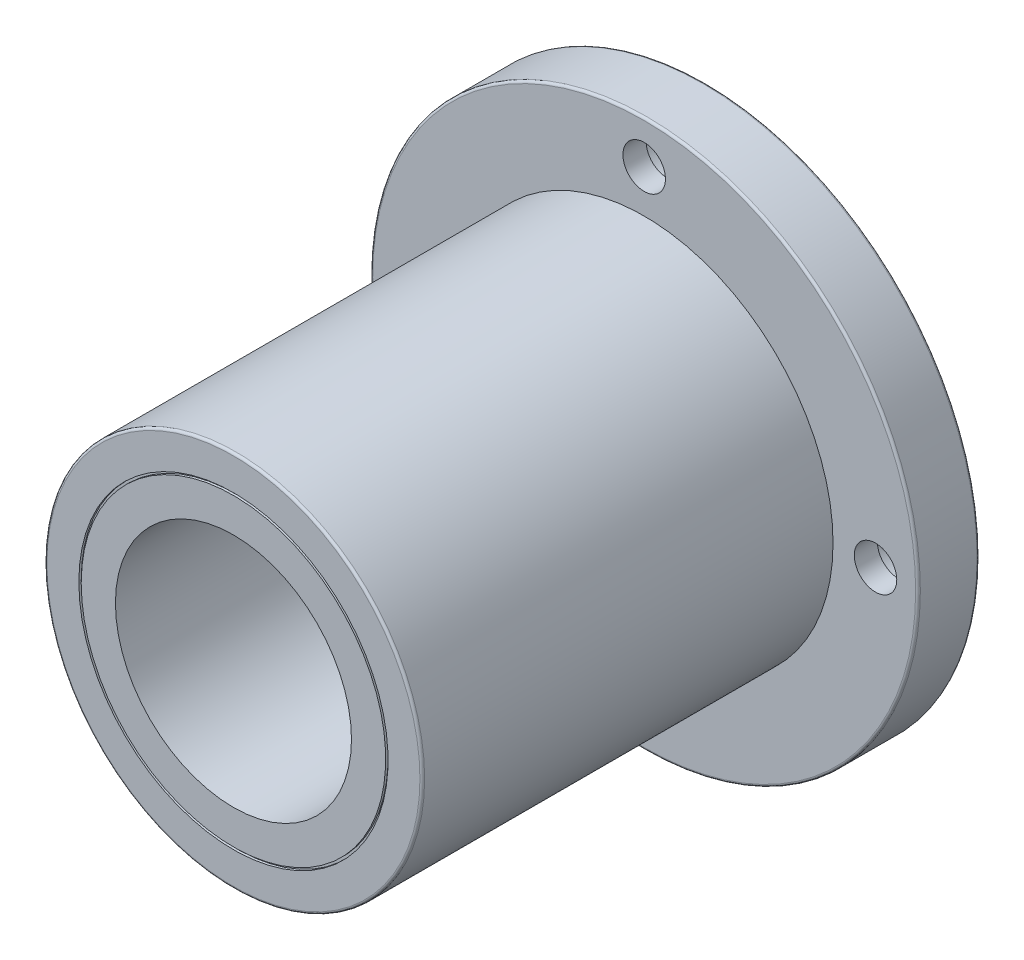
ISO-10303-21;
HEADER;
FILE_DESCRIPTION(('STEP AP214'),'2;1');
FILE_NAME('part.step','',(''),(''),'','','');
FILE_SCHEMA(('AUTOMOTIVE_DESIGN { 1 0 10303 214 1 1 1 1 }'));
ENDSEC;
DATA;
#1=APPLICATION_CONTEXT('core data for automotive mechanical design processes');
#2=APPLICATION_PROTOCOL_DEFINITION('international standard','automotive_design',2000,#1);
#3=PRODUCT_CONTEXT('',#1,'mechanical');
#4=PRODUCT('Part','Part','',(#3));
#5=PRODUCT_RELATED_PRODUCT_CATEGORY('part','',(#4));
#6=PRODUCT_DEFINITION_FORMATION('','',#4);
#7=PRODUCT_DEFINITION_CONTEXT('part definition',#1,'design');
#8=PRODUCT_DEFINITION('design','',#6,#7);
#9=PRODUCT_DEFINITION_SHAPE('','',#8);
#10=(LENGTH_UNIT() NAMED_UNIT(*) SI_UNIT(.MILLI.,.METRE.));
#11=(NAMED_UNIT(*) PLANE_ANGLE_UNIT() SI_UNIT($,.RADIAN.));
#12=(NAMED_UNIT(*) SI_UNIT($,.STERADIAN.) SOLID_ANGLE_UNIT());
#13=UNCERTAINTY_MEASURE_WITH_UNIT(LENGTH_MEASURE(1.E-05),#10,'distance_accuracy_value','');
#14=(GEOMETRIC_REPRESENTATION_CONTEXT(3) GLOBAL_UNCERTAINTY_ASSIGNED_CONTEXT((#13)) GLOBAL_UNIT_ASSIGNED_CONTEXT((#10,
#11,#12)) REPRESENTATION_CONTEXT('',''));
#15=CARTESIAN_POINT('',(0.,0.,0.));
#16=DIRECTION('',(0.,0.,1.));
#17=DIRECTION('',(1.,0.,0.));
#18=AXIS2_PLACEMENT_3D('',#15,#16,#17);
#19=CARTESIAN_POINT('',(0.,40.,0.));
#20=DIRECTION('',(0.,0.,-1.));
#21=DIRECTION('',(-1.,0.,0.));
#22=AXIS2_PLACEMENT_3D('',#19,#20,#21);
#23=PLANE('',#22);
#24=CARTESIAN_POINT('',(0.,0.,0.));
#25=DIRECTION('',(0.,0.,-1.));
#26=DIRECTION('',(-1.,0.,0.));
#27=AXIS2_PLACEMENT_3D('',#24,#25,#26);
#28=CIRCLE('',#27,57.5);
#29=CARTESIAN_POINT('',(-57.5,0.,0.));
#30=VERTEX_POINT('',#29);
#31=EDGE_CURVE('E71',#30,#30,#28,.T.);
#32=ORIENTED_EDGE('',*,*,#31,.T.);
#33=EDGE_LOOP('',(#32));
#34=FACE_BOUND('',#33,.T.);
#35=CARTESIAN_POINT('',(0.,-49.,0.));
#36=DIRECTION('',(0.,0.,1.));
#37=DIRECTION('',(-1.,0.,0.));
#38=AXIS2_PLACEMENT_3D('',#35,#36,#37);
#39=CIRCLE('',#38,7.00000000000001);
#40=CARTESIAN_POINT('',(-7.00000000000001,-49.,0.));
#41=VERTEX_POINT('',#40);
#42=EDGE_CURVE('E165',#41,#41,#39,.T.);
#43=ORIENTED_EDGE('',*,*,#42,.T.);
#44=EDGE_LOOP('',(#43));
#45=FACE_BOUND('',#44,.T.);
#46=CARTESIAN_POINT('',(0.,49.,0.));
#47=DIRECTION('',(0.,0.,1.));
#48=DIRECTION('',(1.,0.,0.));
#49=AXIS2_PLACEMENT_3D('',#46,#47,#48);
#50=CIRCLE('',#49,7.00000000000001);
#51=CARTESIAN_POINT('',(7.00000000000001,49.,0.));
#52=VERTEX_POINT('',#51);
#53=EDGE_CURVE('E135',#52,#52,#50,.T.);
#54=ORIENTED_EDGE('',*,*,#53,.T.);
#55=EDGE_LOOP('',(#54));
#56=FACE_BOUND('',#55,.T.);
#57=CARTESIAN_POINT('',(0.,0.,0.));
#58=DIRECTION('',(0.,0.,-1.));
#59=DIRECTION('',(-1.,0.,0.));
#60=AXIS2_PLACEMENT_3D('',#57,#58,#59);
#61=CIRCLE('',#60,40.);
#62=CARTESIAN_POINT('',(-40.,0.,0.));
#63=VERTEX_POINT('',#62);
#64=EDGE_CURVE('E131',#63,#63,#61,.T.);
#65=ORIENTED_EDGE('',*,*,#64,.F.);
#66=EDGE_LOOP('',(#65));
#67=FACE_BOUND('',#66,.T.);
#68=CARTESIAN_POINT('',(49.,-1.71082585603314E-13,0.));
#69=DIRECTION('',(0.,0.,1.));
#70=DIRECTION('',(0.,-1.,0.));
#71=AXIS2_PLACEMENT_3D('',#68,#69,#70);
#72=CIRCLE('',#71,7.00000000000001);
#73=CARTESIAN_POINT('',(49.,-7.00000000000018,0.));
#74=VERTEX_POINT('',#73);
#75=EDGE_CURVE('E150',#74,#74,#72,.T.);
#76=ORIENTED_EDGE('',*,*,#75,.T.);
#77=EDGE_LOOP('',(#76));
#78=FACE_BOUND('',#77,.T.);
#79=CARTESIAN_POINT('',(-49.,5.13247756809941E-13,0.));
#80=DIRECTION('',(0.,0.,1.));
#81=DIRECTION('',(0.,1.,0.));
#82=AXIS2_PLACEMENT_3D('',#79,#80,#81);
#83=CIRCLE('',#82,7.00000000000001);
#84=CARTESIAN_POINT('',(-48.9999999999999,7.00000000000052,0.));
#85=VERTEX_POINT('',#84);
#86=EDGE_CURVE('E180',#85,#85,#83,.T.);
#87=ORIENTED_EDGE('',*,*,#86,.T.);
#88=EDGE_LOOP('',(#87));
#89=FACE_BOUND('',#88,.T.);
#90=ADVANCED_FACE('F40',(#34,#45,#56,#67,#78,#89),#23,.T.);
#91=CARTESIAN_POINT('',(0.,58.,13.));
#92=DIRECTION('',(0.,0.,1.));
#93=DIRECTION('',(1.,0.,0.));
#94=AXIS2_PLACEMENT_3D('',#91,#92,#93);
#95=PLANE('',#94);
#96=CARTESIAN_POINT('',(0.,0.,13.));
#97=DIRECTION('',(0.,0.,1.));
#98=DIRECTION('',(1.,0.,0.));
#99=AXIS2_PLACEMENT_3D('',#96,#97,#98);
#100=CIRCLE('',#99,57.5);
#101=CARTESIAN_POINT('',(57.5,0.,13.));
#102=VERTEX_POINT('',#101);
#103=EDGE_CURVE('E55',#102,#102,#100,.T.);
#104=ORIENTED_EDGE('',*,*,#103,.T.);
#105=EDGE_LOOP('',(#104));
#106=FACE_BOUND('',#105,.T.);
#107=CARTESIAN_POINT('',(0.,-49.,13.));
#108=DIRECTION('',(0.,0.,1.));
#109=DIRECTION('',(-1.,0.,0.));
#110=AXIS2_PLACEMENT_3D('',#107,#108,#109);
#111=CIRCLE('',#110,4.49999999999999);
#112=CARTESIAN_POINT('',(-4.49999999999999,-49.,13.));
#113=VERTEX_POINT('',#112);
#114=EDGE_CURVE('E176',#113,#113,#111,.T.);
#115=ORIENTED_EDGE('',*,*,#114,.F.);
#116=EDGE_LOOP('',(#115));
#117=FACE_BOUND('',#116,.T.);
#118=CARTESIAN_POINT('',(0.,49.,13.));
#119=DIRECTION('',(0.,0.,1.));
#120=DIRECTION('',(1.,0.,0.));
#121=AXIS2_PLACEMENT_3D('',#118,#119,#120);
#122=CIRCLE('',#121,4.49999999999999);
#123=CARTESIAN_POINT('',(4.49999999999999,49.,13.));
#124=VERTEX_POINT('',#123);
#125=EDGE_CURVE('E146',#124,#124,#122,.T.);
#126=ORIENTED_EDGE('',*,*,#125,.F.);
#127=EDGE_LOOP('',(#126));
#128=FACE_BOUND('',#127,.T.);
#129=CARTESIAN_POINT('',(0.,0.,13.));
#130=DIRECTION('',(0.,0.,-1.));
#131=DIRECTION('',(-1.,0.,0.));
#132=AXIS2_PLACEMENT_3D('',#129,#130,#131);
#133=CIRCLE('',#132,40.);
#134=CARTESIAN_POINT('',(-40.,0.,13.));
#135=VERTEX_POINT('',#134);
#136=EDGE_CURVE('E75',#135,#135,#133,.T.);
#137=ORIENTED_EDGE('',*,*,#136,.T.);
#138=EDGE_LOOP('',(#137));
#139=FACE_BOUND('',#138,.T.);
#140=CARTESIAN_POINT('',(49.,-1.71082585603314E-13,13.));
#141=DIRECTION('',(0.,0.,1.));
#142=DIRECTION('',(0.,-1.,0.));
#143=AXIS2_PLACEMENT_3D('',#140,#141,#142);
#144=CIRCLE('',#143,4.49999999999999);
#145=CARTESIAN_POINT('',(49.,-4.50000000000016,13.));
#146=VERTEX_POINT('',#145);
#147=EDGE_CURVE('E161',#146,#146,#144,.T.);
#148=ORIENTED_EDGE('',*,*,#147,.F.);
#149=EDGE_LOOP('',(#148));
#150=FACE_BOUND('',#149,.T.);
#151=CARTESIAN_POINT('',(-49.,5.13247756809941E-13,13.));
#152=DIRECTION('',(0.,0.,1.));
#153=DIRECTION('',(0.,1.,0.));
#154=AXIS2_PLACEMENT_3D('',#151,#152,#153);
#155=CIRCLE('',#154,4.49999999999999);
#156=CARTESIAN_POINT('',(-49.,4.5000000000005,13.));
#157=VERTEX_POINT('',#156);
#158=EDGE_CURVE('E192',#157,#157,#155,.T.);
#159=ORIENTED_EDGE('',*,*,#158,.F.);
#160=EDGE_LOOP('',(#159));
#161=FACE_BOUND('',#160,.T.);
#162=ADVANCED_FACE('F200',(#106,#117,#128,#139,#150,#161),#95,.T.);
#163=CARTESIAN_POINT('',(0.,0.,0.));
#164=DIRECTION('',(0.,0.,-1.));
#165=DIRECTION('',(-1.,0.,0.));
#166=AXIS2_PLACEMENT_3D('',#163,#164,#165);
#167=CYLINDRICAL_SURFACE('',#166,58.);
#168=CARTESIAN_POINT('',(0.,0.,0.500000000000001));
#169=DIRECTION('',(0.,0.,-1.));
#170=DIRECTION('',(-1.,0.,0.));
#171=AXIS2_PLACEMENT_3D('',#168,#169,#170);
#172=CIRCLE('',#171,58.);
#173=CARTESIAN_POINT('',(-58.,0.,0.500000000000001));
#174=VERTEX_POINT('',#173);
#175=EDGE_CURVE('E62',#174,#174,#172,.F.);
#176=ORIENTED_EDGE('',*,*,#175,.T.);
#177=EDGE_LOOP('',(#176));
#178=FACE_BOUND('',#177,.T.);
#179=CARTESIAN_POINT('',(0.,0.,12.5));
#180=DIRECTION('',(0.,0.,1.));
#181=DIRECTION('',(1.,0.,0.));
#182=AXIS2_PLACEMENT_3D('',#179,#180,#181);
#183=CIRCLE('',#182,58.);
#184=CARTESIAN_POINT('',(58.,0.,12.5));
#185=VERTEX_POINT('',#184);
#186=EDGE_CURVE('E68',#185,#185,#183,.F.);
#187=ORIENTED_EDGE('',*,*,#186,.T.);
#188=EDGE_LOOP('',(#187));
#189=FACE_BOUND('',#188,.T.);
#190=ADVANCED_FACE('F202',(#178,#189),#167,.T.);
#191=CARTESIAN_POINT('',(0.,0.,0.));
#192=DIRECTION('',(0.,0.,-1.));
#193=DIRECTION('',(-1.,0.,0.));
#194=AXIS2_PLACEMENT_3D('',#191,#192,#193);
#195=CYLINDRICAL_SURFACE('',#194,40.);
#196=CARTESIAN_POINT('',(0.,0.,99.5));
#197=DIRECTION('',(0.,0.,1.));
#198=DIRECTION('',(1.,0.,0.));
#199=AXIS2_PLACEMENT_3D('',#196,#197,#198);
#200=CIRCLE('',#199,40.);
#201=CARTESIAN_POINT('',(40.,0.,99.5));
#202=VERTEX_POINT('',#201);
#203=EDGE_CURVE('E48',#202,#202,#200,.F.);
#204=ORIENTED_EDGE('',*,*,#203,.T.);
#205=EDGE_LOOP('',(#204));
#206=FACE_BOUND('',#205,.T.);
#207=ORIENTED_EDGE('',*,*,#136,.F.);
#208=EDGE_LOOP('',(#207));
#209=FACE_BOUND('',#208,.T.);
#210=ADVANCED_FACE('F209',(#206,#209),#195,.T.);
#211=CARTESIAN_POINT('',(0.,40.,100.));
#212=DIRECTION('',(0.,0.,1.));
#213=DIRECTION('',(1.,0.,0.));
#214=AXIS2_PLACEMENT_3D('',#211,#212,#213);
#215=PLANE('',#214);
#216=CARTESIAN_POINT('',(0.,0.,100.));
#217=DIRECTION('',(0.,0.,1.));
#218=DIRECTION('',(1.,0.,0.));
#219=AXIS2_PLACEMENT_3D('',#216,#217,#218);
#220=CIRCLE('',#219,39.5);
#221=CARTESIAN_POINT('',(39.5,0.,100.));
#222=VERTEX_POINT('',#221);
#223=EDGE_CURVE('E10',#222,#222,#220,.T.);
#224=ORIENTED_EDGE('',*,*,#223,.T.);
#225=EDGE_LOOP('',(#224));
#226=FACE_BOUND('',#225,.T.);
#227=CARTESIAN_POINT('',(0.,0.,100.));
#228=DIRECTION('',(0.,0.,-1.));
#229=DIRECTION('',(-1.,0.,0.));
#230=AXIS2_PLACEMENT_3D('',#227,#228,#229);
#231=CIRCLE('',#230,32.75);
#232=CARTESIAN_POINT('',(-32.75,0.,100.));
#233=VERTEX_POINT('',#232);
#234=EDGE_CURVE('E79',#233,#233,#231,.T.);
#235=ORIENTED_EDGE('',*,*,#234,.T.);
#236=EDGE_LOOP('',(#235));
#237=FACE_BOUND('',#236,.T.);
#238=ADVANCED_FACE('F466',(#226,#237),#215,.T.);
#239=CARTESIAN_POINT('',(0.,0.,0.));
#240=DIRECTION('',(0.,0.,-1.));
#241=DIRECTION('',(-1.,0.,0.));
#242=AXIS2_PLACEMENT_3D('',#239,#240,#241);
#243=CYLINDRICAL_SURFACE('',#242,32.75);
#244=CARTESIAN_POINT('',(0.,0.,99.5));
#245=DIRECTION('',(0.,0.,-1.));
#246=DIRECTION('',(-1.,0.,0.));
#247=AXIS2_PLACEMENT_3D('',#244,#245,#246);
#248=CIRCLE('',#247,32.75);
#249=CARTESIAN_POINT('',(-32.75,0.,99.5));
#250=VERTEX_POINT('',#249);
#251=EDGE_CURVE('E83',#250,#250,#248,.T.);
#252=ORIENTED_EDGE('',*,*,#251,.T.);
#253=EDGE_LOOP('',(#252));
#254=FACE_BOUND('',#253,.T.);
#255=ORIENTED_EDGE('',*,*,#234,.F.);
#256=EDGE_LOOP('',(#255));
#257=FACE_BOUND('',#256,.T.);
#258=ADVANCED_FACE('F457',(#254,#257),#243,.F.);
#259=CARTESIAN_POINT('',(0.,32.75,99.5));
#260=DIRECTION('',(0.,0.,1.));
#261=DIRECTION('',(1.,0.,0.));
#262=AXIS2_PLACEMENT_3D('',#259,#260,#261);
#263=PLANE('',#262);
#264=CARTESIAN_POINT('',(0.,0.,99.5));
#265=DIRECTION('',(0.,0.,-1.));
#266=DIRECTION('',(-1.,0.,0.));
#267=AXIS2_PLACEMENT_3D('',#264,#265,#266);
#268=CIRCLE('',#267,32.25);
#269=CARTESIAN_POINT('',(-32.25,0.,99.5));
#270=VERTEX_POINT('',#269);
#271=EDGE_CURVE('E87',#270,#270,#268,.T.);
#272=ORIENTED_EDGE('',*,*,#271,.T.);
#273=EDGE_LOOP('',(#272));
#274=FACE_BOUND('',#273,.T.);
#275=ORIENTED_EDGE('',*,*,#251,.F.);
#276=EDGE_LOOP('',(#275));
#277=FACE_BOUND('',#276,.T.);
#278=ADVANCED_FACE('F448',(#274,#277),#263,.T.);
#279=CARTESIAN_POINT('',(0.,0.,0.));
#280=DIRECTION('',(0.,0.,-1.));
#281=DIRECTION('',(-1.,0.,0.));
#282=AXIS2_PLACEMENT_3D('',#279,#280,#281);
#283=CYLINDRICAL_SURFACE('',#282,32.25);
#284=CARTESIAN_POINT('',(0.,0.,100.));
#285=DIRECTION('',(0.,0.,-1.));
#286=DIRECTION('',(-1.,0.,0.));
#287=AXIS2_PLACEMENT_3D('',#284,#285,#286);
#288=CIRCLE('',#287,32.25);
#289=CARTESIAN_POINT('',(-32.25,0.,100.));
#290=VERTEX_POINT('',#289);
#291=EDGE_CURVE('E91',#290,#290,#288,.T.);
#292=ORIENTED_EDGE('',*,*,#291,.T.);
#293=EDGE_LOOP('',(#292));
#294=FACE_BOUND('',#293,.T.);
#295=ORIENTED_EDGE('',*,*,#271,.F.);
#296=EDGE_LOOP('',(#295));
#297=FACE_BOUND('',#296,.T.);
#298=ADVANCED_FACE('F440',(#294,#297),#283,.T.);
#299=CARTESIAN_POINT('',(0.,32.25,100.));
#300=DIRECTION('',(0.,0.,1.));
#301=DIRECTION('',(1.,0.,0.));
#302=AXIS2_PLACEMENT_3D('',#299,#300,#301);
#303=PLANE('',#302);
#304=CARTESIAN_POINT('',(0.,0.,100.));
#305=DIRECTION('',(0.,0.,-1.));
#306=DIRECTION('',(-1.,0.,0.));
#307=AXIS2_PLACEMENT_3D('',#304,#305,#306);
#308=CIRCLE('',#307,25.);
#309=CARTESIAN_POINT('',(-25.,0.,100.));
#310=VERTEX_POINT('',#309);
#311=EDGE_CURVE('E95',#310,#310,#308,.T.);
#312=ORIENTED_EDGE('',*,*,#311,.T.);
#313=EDGE_LOOP('',(#312));
#314=FACE_BOUND('',#313,.T.);
#315=ORIENTED_EDGE('',*,*,#291,.F.);
#316=EDGE_LOOP('',(#315));
#317=FACE_BOUND('',#316,.T.);
#318=ADVANCED_FACE('F432',(#314,#317),#303,.T.);
#319=CARTESIAN_POINT('',(0.,0.,0.));
#320=DIRECTION('',(0.,0.,-1.));
#321=DIRECTION('',(-1.,0.,0.));
#322=AXIS2_PLACEMENT_3D('',#319,#320,#321);
#323=CYLINDRICAL_SURFACE('',#322,25.);
#324=CARTESIAN_POINT('',(0.,0.,0.));
#325=DIRECTION('',(0.,0.,-1.));
#326=DIRECTION('',(-1.,0.,0.));
#327=AXIS2_PLACEMENT_3D('',#324,#325,#326);
#328=CIRCLE('',#327,25.);
#329=CARTESIAN_POINT('',(-25.,0.,0.));
#330=VERTEX_POINT('',#329);
#331=EDGE_CURVE('E99',#330,#330,#328,.T.);
#332=ORIENTED_EDGE('',*,*,#331,.T.);
#333=EDGE_LOOP('',(#332));
#334=FACE_BOUND('',#333,.T.);
#335=ORIENTED_EDGE('',*,*,#311,.F.);
#336=EDGE_LOOP('',(#335));
#337=FACE_BOUND('',#336,.T.);
#338=ADVANCED_FACE('F423',(#334,#337),#323,.F.);
#339=CARTESIAN_POINT('',(0.,25.,0.));
#340=DIRECTION('',(0.,0.,-1.));
#341=DIRECTION('',(-1.,0.,0.));
#342=AXIS2_PLACEMENT_3D('',#339,#340,#341);
#343=PLANE('',#342);
#344=CARTESIAN_POINT('',(0.,0.,0.));
#345=DIRECTION('',(0.,0.,-1.));
#346=DIRECTION('',(-1.,0.,0.));
#347=AXIS2_PLACEMENT_3D('',#344,#345,#346);
#348=CIRCLE('',#347,32.25);
#349=CARTESIAN_POINT('',(-32.25,0.,0.));
#350=VERTEX_POINT('',#349);
#351=EDGE_CURVE('E103',#350,#350,#348,.T.);
#352=ORIENTED_EDGE('',*,*,#351,.T.);
#353=EDGE_LOOP('',(#352));
#354=FACE_BOUND('',#353,.T.);
#355=ORIENTED_EDGE('',*,*,#331,.F.);
#356=EDGE_LOOP('',(#355));
#357=FACE_BOUND('',#356,.T.);
#358=ADVANCED_FACE('F414',(#354,#357),#343,.T.);
#359=CARTESIAN_POINT('',(0.,0.,0.));
#360=DIRECTION('',(0.,0.,-1.));
#361=DIRECTION('',(-1.,0.,0.));
#362=AXIS2_PLACEMENT_3D('',#359,#360,#361);
#363=CYLINDRICAL_SURFACE('',#362,32.25);
#364=CARTESIAN_POINT('',(0.,0.,0.5));
#365=DIRECTION('',(0.,0.,-1.));
#366=DIRECTION('',(-1.,0.,0.));
#367=AXIS2_PLACEMENT_3D('',#364,#365,#366);
#368=CIRCLE('',#367,32.25);
#369=CARTESIAN_POINT('',(-32.25,0.,0.5));
#370=VERTEX_POINT('',#369);
#371=EDGE_CURVE('E107',#370,#370,#368,.T.);
#372=ORIENTED_EDGE('',*,*,#371,.T.);
#373=EDGE_LOOP('',(#372));
#374=FACE_BOUND('',#373,.T.);
#375=ORIENTED_EDGE('',*,*,#351,.F.);
#376=EDGE_LOOP('',(#375));
#377=FACE_BOUND('',#376,.T.);
#378=ADVANCED_FACE('F405',(#374,#377),#363,.T.);
#379=CARTESIAN_POINT('',(0.,32.75,0.5));
#380=DIRECTION('',(0.,0.,-1.));
#381=DIRECTION('',(-1.,0.,0.));
#382=AXIS2_PLACEMENT_3D('',#379,#380,#381);
#383=PLANE('',#382);
#384=CARTESIAN_POINT('',(0.,0.,0.5));
#385=DIRECTION('',(0.,0.,-1.));
#386=DIRECTION('',(-1.,0.,0.));
#387=AXIS2_PLACEMENT_3D('',#384,#385,#386);
#388=CIRCLE('',#387,32.75);
#389=CARTESIAN_POINT('',(-32.75,0.,0.5));
#390=VERTEX_POINT('',#389);
#391=EDGE_CURVE('E111',#390,#390,#388,.T.);
#392=ORIENTED_EDGE('',*,*,#391,.T.);
#393=EDGE_LOOP('',(#392));
#394=FACE_BOUND('',#393,.T.);
#395=ORIENTED_EDGE('',*,*,#371,.F.);
#396=EDGE_LOOP('',(#395));
#397=FACE_BOUND('',#396,.T.);
#398=ADVANCED_FACE('F396',(#394,#397),#383,.T.);
#399=CARTESIAN_POINT('',(0.,0.,0.));
#400=DIRECTION('',(0.,0.,-1.));
#401=DIRECTION('',(-1.,0.,0.));
#402=AXIS2_PLACEMENT_3D('',#399,#400,#401);
#403=CYLINDRICAL_SURFACE('',#402,32.75);
#404=CARTESIAN_POINT('',(0.,0.,0.));
#405=DIRECTION('',(0.,0.,-1.));
#406=DIRECTION('',(-1.,0.,0.));
#407=AXIS2_PLACEMENT_3D('',#404,#405,#406);
#408=CIRCLE('',#407,32.75);
#409=CARTESIAN_POINT('',(-32.75,0.,0.));
#410=VERTEX_POINT('',#409);
#411=EDGE_CURVE('E115',#410,#410,#408,.T.);
#412=ORIENTED_EDGE('',*,*,#411,.T.);
#413=EDGE_LOOP('',(#412));
#414=FACE_BOUND('',#413,.T.);
#415=ORIENTED_EDGE('',*,*,#391,.F.);
#416=EDGE_LOOP('',(#415));
#417=FACE_BOUND('',#416,.T.);
#418=ADVANCED_FACE('F387',(#414,#417),#403,.F.);
#419=CARTESIAN_POINT('',(0.,32.75,0.));
#420=DIRECTION('',(0.,0.,-1.));
#421=DIRECTION('',(-1.,0.,0.));
#422=AXIS2_PLACEMENT_3D('',#419,#420,#421);
#423=PLANE('',#422);
#424=CARTESIAN_POINT('',(0.,0.,0.));
#425=DIRECTION('',(0.,0.,-1.));
#426=DIRECTION('',(-1.,0.,0.));
#427=AXIS2_PLACEMENT_3D('',#424,#425,#426);
#428=CIRCLE('',#427,39.5);
#429=CARTESIAN_POINT('',(-39.5,0.,0.));
#430=VERTEX_POINT('',#429);
#431=EDGE_CURVE('E119',#430,#430,#428,.T.);
#432=ORIENTED_EDGE('',*,*,#431,.T.);
#433=EDGE_LOOP('',(#432));
#434=FACE_BOUND('',#433,.T.);
#435=ORIENTED_EDGE('',*,*,#411,.F.);
#436=EDGE_LOOP('',(#435));
#437=FACE_BOUND('',#436,.T.);
#438=ADVANCED_FACE('F378',(#434,#437),#423,.T.);
#439=CARTESIAN_POINT('',(0.,0.,0.));
#440=DIRECTION('',(0.,0.,-1.));
#441=DIRECTION('',(-1.,0.,0.));
#442=AXIS2_PLACEMENT_3D('',#439,#440,#441);
#443=CYLINDRICAL_SURFACE('',#442,39.5);
#444=CARTESIAN_POINT('',(0.,0.,0.500000000000001));
#445=DIRECTION('',(0.,0.,-1.));
#446=DIRECTION('',(-1.,0.,0.));
#447=AXIS2_PLACEMENT_3D('',#444,#445,#446);
#448=CIRCLE('',#447,39.5);
#449=CARTESIAN_POINT('',(-39.5,0.,0.500000000000001));
#450=VERTEX_POINT('',#449);
#451=EDGE_CURVE('E123',#450,#450,#448,.T.);
#452=ORIENTED_EDGE('',*,*,#451,.T.);
#453=EDGE_LOOP('',(#452));
#454=FACE_BOUND('',#453,.T.);
#455=ORIENTED_EDGE('',*,*,#431,.F.);
#456=EDGE_LOOP('',(#455));
#457=FACE_BOUND('',#456,.T.);
#458=ADVANCED_FACE('F369',(#454,#457),#443,.T.);
#459=CARTESIAN_POINT('',(0.,40.,0.500000000000001));
#460=DIRECTION('',(0.,0.,-1.));
#461=DIRECTION('',(-1.,0.,0.));
#462=AXIS2_PLACEMENT_3D('',#459,#460,#461);
#463=PLANE('',#462);
#464=CARTESIAN_POINT('',(0.,0.,0.500000000000001));
#465=DIRECTION('',(0.,0.,-1.));
#466=DIRECTION('',(-1.,0.,0.));
#467=AXIS2_PLACEMENT_3D('',#464,#465,#466);
#468=CIRCLE('',#467,40.);
#469=CARTESIAN_POINT('',(-40.,0.,0.500000000000001));
#470=VERTEX_POINT('',#469);
#471=EDGE_CURVE('E127',#470,#470,#468,.T.);
#472=ORIENTED_EDGE('',*,*,#471,.T.);
#473=EDGE_LOOP('',(#472));
#474=FACE_BOUND('',#473,.T.);
#475=ORIENTED_EDGE('',*,*,#451,.F.);
#476=EDGE_LOOP('',(#475));
#477=FACE_BOUND('',#476,.T.);
#478=ADVANCED_FACE('F360',(#474,#477),#463,.T.);
#479=CARTESIAN_POINT('',(0.,0.,0.));
#480=DIRECTION('',(0.,0.,-1.));
#481=DIRECTION('',(-1.,0.,0.));
#482=AXIS2_PLACEMENT_3D('',#479,#480,#481);
#483=CYLINDRICAL_SURFACE('',#482,40.);
#484=ORIENTED_EDGE('',*,*,#64,.T.);
#485=EDGE_LOOP('',(#484));
#486=FACE_BOUND('',#485,.T.);
#487=ORIENTED_EDGE('',*,*,#471,.F.);
#488=EDGE_LOOP('',(#487));
#489=FACE_BOUND('',#488,.T.);
#490=ADVANCED_FACE('F351',(#486,#489),#483,.F.);
#491=CARTESIAN_POINT('',(0.,49.,0.));
#492=DIRECTION('',(0.,0.,1.));
#493=DIRECTION('',(1.,0.,0.));
#494=AXIS2_PLACEMENT_3D('',#491,#492,#493);
#495=CYLINDRICAL_SURFACE('',#494,7.00000000000001);
#496=CARTESIAN_POINT('',(0.,49.,8.1));
#497=DIRECTION('',(0.,0.,1.));
#498=DIRECTION('',(1.,0.,0.));
#499=AXIS2_PLACEMENT_3D('',#496,#497,#498);
#500=CIRCLE('',#499,7.00000000000001);
#501=CARTESIAN_POINT('',(7.00000000000001,49.,8.1));
#502=VERTEX_POINT('',#501);
#503=EDGE_CURVE('E139',#502,#502,#500,.T.);
#504=ORIENTED_EDGE('',*,*,#503,.T.);
#505=EDGE_LOOP('',(#504));
#506=FACE_BOUND('',#505,.T.);
#507=ORIENTED_EDGE('',*,*,#53,.F.);
#508=EDGE_LOOP('',(#507));
#509=FACE_BOUND('',#508,.T.);
#510=ADVANCED_FACE('F342',(#506,#509),#495,.F.);
#511=CARTESIAN_POINT('',(0.,56.,8.1));
#512=DIRECTION('',(0.,0.,-1.));
#513=DIRECTION('',(-1.,0.,0.));
#514=AXIS2_PLACEMENT_3D('',#511,#512,#513);
#515=PLANE('',#514);
#516=CARTESIAN_POINT('',(0.,49.,8.1));
#517=DIRECTION('',(0.,0.,1.));
#518=DIRECTION('',(1.,0.,0.));
#519=AXIS2_PLACEMENT_3D('',#516,#517,#518);
#520=CIRCLE('',#519,4.49999999999999);
#521=CARTESIAN_POINT('',(4.49999999999999,49.,8.1));
#522=VERTEX_POINT('',#521);
#523=EDGE_CURVE('E142',#522,#522,#520,.T.);
#524=ORIENTED_EDGE('',*,*,#523,.T.);
#525=EDGE_LOOP('',(#524));
#526=FACE_BOUND('',#525,.T.);
#527=ORIENTED_EDGE('',*,*,#503,.F.);
#528=EDGE_LOOP('',(#527));
#529=FACE_BOUND('',#528,.T.);
#530=ADVANCED_FACE('F333',(#526,#529),#515,.T.);
#531=CARTESIAN_POINT('',(0.,49.,0.));
#532=DIRECTION('',(0.,0.,1.));
#533=DIRECTION('',(1.,0.,0.));
#534=AXIS2_PLACEMENT_3D('',#531,#532,#533);
#535=CYLINDRICAL_SURFACE('',#534,4.49999999999999);
#536=ORIENTED_EDGE('',*,*,#125,.T.);
#537=EDGE_LOOP('',(#536));
#538=FACE_BOUND('',#537,.T.);
#539=ORIENTED_EDGE('',*,*,#523,.F.);
#540=EDGE_LOOP('',(#539));
#541=FACE_BOUND('',#540,.T.);
#542=ADVANCED_FACE('F324',(#538,#541),#535,.F.);
#543=CARTESIAN_POINT('',(49.,-1.71082585603314E-13,0.));
#544=DIRECTION('',(0.,0.,1.));
#545=DIRECTION('',(0.,-1.,0.));
#546=AXIS2_PLACEMENT_3D('',#543,#544,#545);
#547=CYLINDRICAL_SURFACE('',#546,7.00000000000001);
#548=CARTESIAN_POINT('',(49.,-1.71082585603314E-13,8.1));
#549=DIRECTION('',(0.,0.,1.));
#550=DIRECTION('',(0.,-1.,0.));
#551=AXIS2_PLACEMENT_3D('',#548,#549,#550);
#552=CIRCLE('',#551,7.00000000000001);
#553=CARTESIAN_POINT('',(49.,-7.00000000000018,8.1));
#554=VERTEX_POINT('',#553);
#555=EDGE_CURVE('E153',#554,#554,#552,.T.);
#556=ORIENTED_EDGE('',*,*,#555,.T.);
#557=EDGE_LOOP('',(#556));
#558=FACE_BOUND('',#557,.T.);
#559=ORIENTED_EDGE('',*,*,#75,.F.);
#560=EDGE_LOOP('',(#559));
#561=FACE_BOUND('',#560,.T.);
#562=ADVANCED_FACE('F316',(#558,#561),#547,.F.);
#563=CARTESIAN_POINT('',(56.,-1.95522954975215E-13,8.1));
#564=DIRECTION('',(0.,0.,-1.));
#565=DIRECTION('',(0.,1.,0.));
#566=AXIS2_PLACEMENT_3D('',#563,#564,#565);
#567=PLANE('',#566);
#568=CARTESIAN_POINT('',(49.,-1.71082585603314E-13,8.1));
#569=DIRECTION('',(0.,0.,1.));
#570=DIRECTION('',(0.,-1.,0.));
#571=AXIS2_PLACEMENT_3D('',#568,#569,#570);
#572=CIRCLE('',#571,4.49999999999999);
#573=CARTESIAN_POINT('',(49.,-4.50000000000016,8.1));
#574=VERTEX_POINT('',#573);
#575=EDGE_CURVE('E157',#574,#574,#572,.T.);
#576=ORIENTED_EDGE('',*,*,#575,.T.);
#577=EDGE_LOOP('',(#576));
#578=FACE_BOUND('',#577,.T.);
#579=ORIENTED_EDGE('',*,*,#555,.F.);
#580=EDGE_LOOP('',(#579));
#581=FACE_BOUND('',#580,.T.);
#582=ADVANCED_FACE('F308',(#578,#581),#567,.T.);
#583=CARTESIAN_POINT('',(49.,-1.71082585603314E-13,0.));
#584=DIRECTION('',(0.,0.,1.));
#585=DIRECTION('',(0.,-1.,0.));
#586=AXIS2_PLACEMENT_3D('',#583,#584,#585);
#587=CYLINDRICAL_SURFACE('',#586,4.49999999999999);
#588=ORIENTED_EDGE('',*,*,#147,.T.);
#589=EDGE_LOOP('',(#588));
#590=FACE_BOUND('',#589,.T.);
#591=ORIENTED_EDGE('',*,*,#575,.F.);
#592=EDGE_LOOP('',(#591));
#593=FACE_BOUND('',#592,.T.);
#594=ADVANCED_FACE('F300',(#590,#593),#587,.F.);
#595=CARTESIAN_POINT('',(0.,-49.,0.));
#596=DIRECTION('',(0.,0.,1.));
#597=DIRECTION('',(-1.,0.,0.));
#598=AXIS2_PLACEMENT_3D('',#595,#596,#597);
#599=CYLINDRICAL_SURFACE('',#598,7.00000000000001);
#600=CARTESIAN_POINT('',(0.,-49.,8.1));
#601=DIRECTION('',(0.,0.,1.));
#602=DIRECTION('',(-1.,0.,0.));
#603=AXIS2_PLACEMENT_3D('',#600,#601,#602);
#604=CIRCLE('',#603,7.00000000000001);
#605=CARTESIAN_POINT('',(-7.00000000000001,-49.,8.1));
#606=VERTEX_POINT('',#605);
#607=EDGE_CURVE('E169',#606,#606,#604,.T.);
#608=ORIENTED_EDGE('',*,*,#607,.T.);
#609=EDGE_LOOP('',(#608));
#610=FACE_BOUND('',#609,.T.);
#611=ORIENTED_EDGE('',*,*,#42,.F.);
#612=EDGE_LOOP('',(#611));
#613=FACE_BOUND('',#612,.T.);
#614=ADVANCED_FACE('F292',(#610,#613),#599,.F.);
#615=CARTESIAN_POINT('',(0.,-56.,8.1));
#616=DIRECTION('',(0.,0.,-1.));
#617=DIRECTION('',(1.,0.,0.));
#618=AXIS2_PLACEMENT_3D('',#615,#616,#617);
#619=PLANE('',#618);
#620=CARTESIAN_POINT('',(0.,-49.,8.1));
#621=DIRECTION('',(0.,0.,1.));
#622=DIRECTION('',(-1.,0.,0.));
#623=AXIS2_PLACEMENT_3D('',#620,#621,#622);
#624=CIRCLE('',#623,4.49999999999999);
#625=CARTESIAN_POINT('',(-4.49999999999999,-49.,8.1));
#626=VERTEX_POINT('',#625);
#627=EDGE_CURVE('E172',#626,#626,#624,.T.);
#628=ORIENTED_EDGE('',*,*,#627,.T.);
#629=EDGE_LOOP('',(#628));
#630=FACE_BOUND('',#629,.T.);
#631=ORIENTED_EDGE('',*,*,#607,.F.);
#632=EDGE_LOOP('',(#631));
#633=FACE_BOUND('',#632,.T.);
#634=ADVANCED_FACE('F283',(#630,#633),#619,.T.);
#635=CARTESIAN_POINT('',(0.,-49.,0.));
#636=DIRECTION('',(0.,0.,1.));
#637=DIRECTION('',(-1.,0.,0.));
#638=AXIS2_PLACEMENT_3D('',#635,#636,#637);
#639=CYLINDRICAL_SURFACE('',#638,4.49999999999999);
#640=ORIENTED_EDGE('',*,*,#114,.T.);
#641=EDGE_LOOP('',(#640));
#642=FACE_BOUND('',#641,.T.);
#643=ORIENTED_EDGE('',*,*,#627,.F.);
#644=EDGE_LOOP('',(#643));
#645=FACE_BOUND('',#644,.T.);
#646=ADVANCED_FACE('F272',(#642,#645),#639,.F.);
#647=CARTESIAN_POINT('',(-49.,5.13247756809941E-13,0.));
#648=DIRECTION('',(0.,0.,1.));
#649=DIRECTION('',(0.,1.,0.));
#650=AXIS2_PLACEMENT_3D('',#647,#648,#649);
#651=CYLINDRICAL_SURFACE('',#650,7.00000000000001);
#652=CARTESIAN_POINT('',(-49.,5.13247756809941E-13,8.1));
#653=DIRECTION('',(0.,0.,1.));
#654=DIRECTION('',(0.,1.,0.));
#655=AXIS2_PLACEMENT_3D('',#652,#653,#654);
#656=CIRCLE('',#655,7.00000000000001);
#657=CARTESIAN_POINT('',(-48.9999999999999,7.00000000000052,8.1));
#658=VERTEX_POINT('',#657);
#659=EDGE_CURVE('E184',#658,#658,#656,.T.);
#660=ORIENTED_EDGE('',*,*,#659,.T.);
#661=EDGE_LOOP('',(#660));
#662=FACE_BOUND('',#661,.T.);
#663=ORIENTED_EDGE('',*,*,#86,.F.);
#664=EDGE_LOOP('',(#663));
#665=FACE_BOUND('',#664,.T.);
#666=ADVANCED_FACE('F261',(#662,#665),#651,.F.);
#667=CARTESIAN_POINT('',(-56.,5.86568864925647E-13,8.1));
#668=DIRECTION('',(0.,0.,-1.));
#669=DIRECTION('',(0.,-1.,0.));
#670=AXIS2_PLACEMENT_3D('',#667,#668,#669);
#671=PLANE('',#670);
#672=CARTESIAN_POINT('',(-49.,5.13247756809941E-13,8.1));
#673=DIRECTION('',(0.,0.,1.));
#674=DIRECTION('',(0.,1.,0.));
#675=AXIS2_PLACEMENT_3D('',#672,#673,#674);
#676=CIRCLE('',#675,4.49999999999999);
#677=CARTESIAN_POINT('',(-49.,4.5000000000005,8.1));
#678=VERTEX_POINT('',#677);
#679=EDGE_CURVE('E188',#678,#678,#676,.T.);
#680=ORIENTED_EDGE('',*,*,#679,.T.);
#681=EDGE_LOOP('',(#680));
#682=FACE_BOUND('',#681,.T.);
#683=ORIENTED_EDGE('',*,*,#659,.F.);
#684=EDGE_LOOP('',(#683));
#685=FACE_BOUND('',#684,.T.);
#686=ADVANCED_FACE('F251',(#682,#685),#671,.T.);
#687=CARTESIAN_POINT('',(-49.,5.13247756809941E-13,0.));
#688=DIRECTION('',(0.,0.,1.));
#689=DIRECTION('',(0.,1.,0.));
#690=AXIS2_PLACEMENT_3D('',#687,#688,#689);
#691=CYLINDRICAL_SURFACE('',#690,4.49999999999999);
#692=ORIENTED_EDGE('',*,*,#158,.T.);
#693=EDGE_LOOP('',(#692));
#694=FACE_BOUND('',#693,.T.);
#695=ORIENTED_EDGE('',*,*,#679,.F.);
#696=EDGE_LOOP('',(#695));
#697=FACE_BOUND('',#696,.T.);
#698=ADVANCED_FACE('F197',(#694,#697),#691,.F.);
#699=CARTESIAN_POINT('',(0.,0.,0.500000000000001));
#700=DIRECTION('',(0.,0.,-1.));
#701=DIRECTION('',(-1.,0.,0.));
#702=AXIS2_PLACEMENT_3D('',#699,#700,#701);
#703=TOROIDAL_SURFACE('',#702,57.5,0.5);
#704=ORIENTED_EDGE('',*,*,#175,.F.);
#705=EDGE_LOOP('',(#704));
#706=FACE_BOUND('',#705,.T.);
#707=ORIENTED_EDGE('',*,*,#31,.F.);
#708=EDGE_LOOP('',(#707));
#709=FACE_BOUND('',#708,.T.);
#710=ADVANCED_FACE('F218',(#706,#709),#703,.T.);
#711=CARTESIAN_POINT('',(0.,0.,12.5));
#712=DIRECTION('',(0.,0.,1.));
#713=DIRECTION('',(1.,0.,0.));
#714=AXIS2_PLACEMENT_3D('',#711,#712,#713);
#715=TOROIDAL_SURFACE('',#714,57.5,0.5);
#716=ORIENTED_EDGE('',*,*,#103,.F.);
#717=EDGE_LOOP('',(#716));
#718=FACE_BOUND('',#717,.T.);
#719=ORIENTED_EDGE('',*,*,#186,.F.);
#720=EDGE_LOOP('',(#719));
#721=FACE_BOUND('',#720,.T.);
#722=ADVANCED_FACE('F220',(#718,#721),#715,.T.);
#723=CARTESIAN_POINT('',(0.,0.,99.5));
#724=DIRECTION('',(0.,0.,1.));
#725=DIRECTION('',(1.,0.,0.));
#726=AXIS2_PLACEMENT_3D('',#723,#724,#725);
#727=TOROIDAL_SURFACE('',#726,39.5,0.5);
#728=ORIENTED_EDGE('',*,*,#223,.F.);
#729=EDGE_LOOP('',(#728));
#730=FACE_BOUND('',#729,.T.);
#731=ORIENTED_EDGE('',*,*,#203,.F.);
#732=EDGE_LOOP('',(#731));
#733=FACE_BOUND('',#732,.T.);
#734=ADVANCED_FACE('F42',(#730,#733),#727,.T.);
#735=CLOSED_SHELL('',(#90,#162,#190,#210,#238,#258,#278,#298,#318,#338,#358,#378,#398,#418,#438,
#458,#478,#490,#510,#530,#542,#562,#582,#594,#614,#634,#646,#666,#686,#698,#710,#722,#734));
#736=MANIFOLD_SOLID_BREP('B2',#735);
#737=ADVANCED_BREP_SHAPE_REPRESENTATION('',(#18,#736),#14);
#738=SHAPE_DEFINITION_REPRESENTATION(#9,#737);
ENDSEC;
END-ISO-10303-21;
